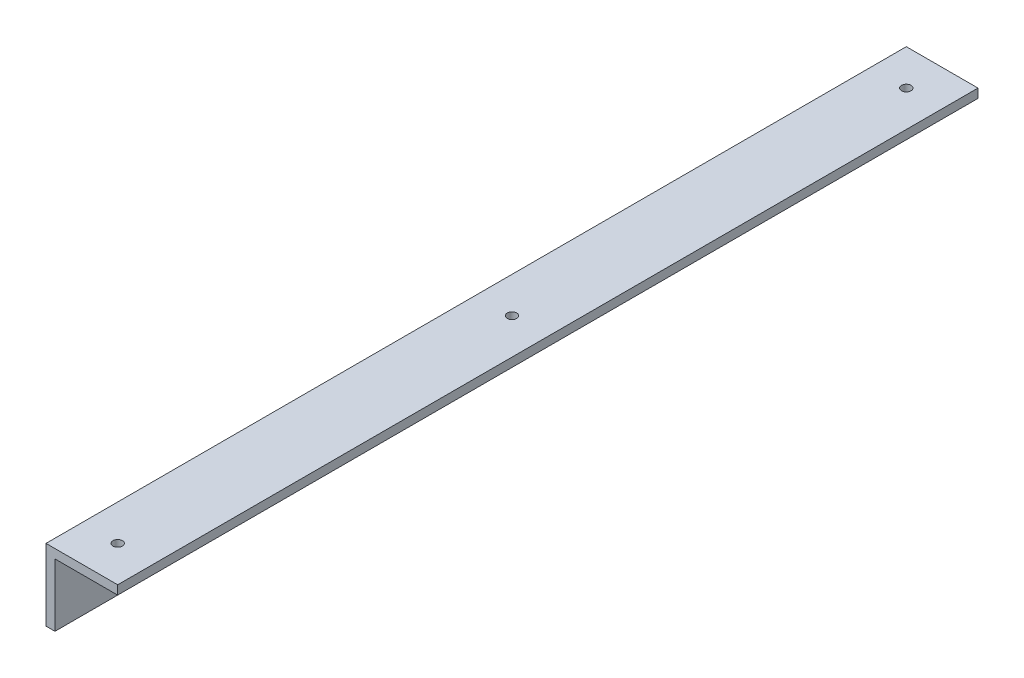
ISO-10303-21;
HEADER;
FILE_DESCRIPTION(('STEP AP214'),'2;1');
FILE_NAME('part.step','',(''),(''),'','','');
FILE_SCHEMA(('AUTOMOTIVE_DESIGN { 1 0 10303 214 1 1 1 1 }'));
ENDSEC;
DATA;
#1=APPLICATION_CONTEXT('core data for automotive mechanical design processes');
#2=APPLICATION_PROTOCOL_DEFINITION('international standard','automotive_design',2000,#1);
#3=PRODUCT_CONTEXT('',#1,'mechanical');
#4=PRODUCT('Part','Part','',(#3));
#5=PRODUCT_RELATED_PRODUCT_CATEGORY('part','',(#4));
#6=PRODUCT_DEFINITION_FORMATION('','',#4);
#7=PRODUCT_DEFINITION_CONTEXT('part definition',#1,'design');
#8=PRODUCT_DEFINITION('design','',#6,#7);
#9=PRODUCT_DEFINITION_SHAPE('','',#8);
#10=(LENGTH_UNIT() NAMED_UNIT(*) SI_UNIT(.MILLI.,.METRE.));
#11=(NAMED_UNIT(*) PLANE_ANGLE_UNIT() SI_UNIT($,.RADIAN.));
#12=(NAMED_UNIT(*) SI_UNIT($,.STERADIAN.) SOLID_ANGLE_UNIT());
#13=UNCERTAINTY_MEASURE_WITH_UNIT(LENGTH_MEASURE(1.E-05),#10,'distance_accuracy_value','');
#14=(GEOMETRIC_REPRESENTATION_CONTEXT(3) GLOBAL_UNCERTAINTY_ASSIGNED_CONTEXT((#13)) GLOBAL_UNIT_ASSIGNED_CONTEXT((#10,
#11,#12)) REPRESENTATION_CONTEXT('',''));
#15=CARTESIAN_POINT('',(0.,0.,0.));
#16=DIRECTION('',(0.,0.,1.));
#17=DIRECTION('',(1.,0.,0.));
#18=AXIS2_PLACEMENT_3D('',#15,#16,#17);
#19=CARTESIAN_POINT('',(0.,-25.4,304.8));
#20=DIRECTION('',(-1.,0.,0.));
#21=DIRECTION('',(0.,0.,1.));
#22=AXIS2_PLACEMENT_3D('',#19,#20,#21);
#23=CYLINDRICAL_SURFACE('',#22,3.3655);
#24=CARTESIAN_POINT('',(0.,-25.4,304.8));
#25=DIRECTION('',(-1.,0.,0.));
#26=DIRECTION('',(0.,0.,1.));
#27=AXIS2_PLACEMENT_3D('',#24,#25,#26);
#28=CIRCLE('',#27,3.3655);
#29=CARTESIAN_POINT('',(0.,-25.4,308.1655));
#30=VERTEX_POINT('',#29);
#31=EDGE_CURVE('E123',#30,#30,#28,.F.);
#32=ORIENTED_EDGE('',*,*,#31,.F.);
#33=EDGE_LOOP('',(#32));
#34=FACE_BOUND('',#33,.T.);
#35=CARTESIAN_POINT('',(6.35,-25.4,304.8));
#36=DIRECTION('',(-1.,0.,0.));
#37=DIRECTION('',(0.,0.,1.));
#38=AXIS2_PLACEMENT_3D('',#35,#36,#37);
#39=CIRCLE('',#38,3.3655);
#40=CARTESIAN_POINT('',(6.35,-25.4,308.1655));
#41=VERTEX_POINT('',#40);
#42=EDGE_CURVE('E20',#41,#41,#39,.T.);
#43=ORIENTED_EDGE('',*,*,#42,.F.);
#44=EDGE_LOOP('',(#43));
#45=FACE_BOUND('',#44,.T.);
#46=ADVANCED_FACE('F17',(#34,#45),#23,.F.);
#47=CARTESIAN_POINT('',(0.,-25.4,558.8));
#48=DIRECTION('',(-1.,0.,0.));
#49=DIRECTION('',(0.,0.,1.));
#50=AXIS2_PLACEMENT_3D('',#47,#48,#49);
#51=CYLINDRICAL_SURFACE('',#50,3.3655);
#52=CARTESIAN_POINT('',(0.,-25.4,558.8));
#53=DIRECTION('',(-1.,0.,0.));
#54=DIRECTION('',(0.,0.,1.));
#55=AXIS2_PLACEMENT_3D('',#52,#53,#54);
#56=CIRCLE('',#55,3.3655);
#57=CARTESIAN_POINT('',(0.,-25.4,562.1655));
#58=VERTEX_POINT('',#57);
#59=EDGE_CURVE('E120',#58,#58,#56,.F.);
#60=ORIENTED_EDGE('',*,*,#59,.F.);
#61=EDGE_LOOP('',(#60));
#62=FACE_BOUND('',#61,.T.);
#63=CARTESIAN_POINT('',(6.35,-25.4,558.8));
#64=DIRECTION('',(-1.,0.,0.));
#65=DIRECTION('',(0.,0.,1.));
#66=AXIS2_PLACEMENT_3D('',#63,#64,#65);
#67=CIRCLE('',#66,3.3655);
#68=CARTESIAN_POINT('',(6.35,-25.4,562.1655));
#69=VERTEX_POINT('',#68);
#70=EDGE_CURVE('E130',#69,#69,#67,.T.);
#71=ORIENTED_EDGE('',*,*,#70,.F.);
#72=EDGE_LOOP('',(#71));
#73=FACE_BOUND('',#72,.T.);
#74=ADVANCED_FACE('F139',(#62,#73),#51,.F.);
#75=CARTESIAN_POINT('',(0.,-15.875,50.8));
#76=DIRECTION('',(-1.,0.,0.));
#77=DIRECTION('',(0.,0.,1.));
#78=AXIS2_PLACEMENT_3D('',#75,#76,#77);
#79=CYLINDRICAL_SURFACE('',#78,3.3655);
#80=CARTESIAN_POINT('',(0.,-15.875,50.8));
#81=DIRECTION('',(-1.,0.,0.));
#82=DIRECTION('',(0.,0.,1.));
#83=AXIS2_PLACEMENT_3D('',#80,#81,#82);
#84=CIRCLE('',#83,3.3655);
#85=CARTESIAN_POINT('',(0.,-15.875,54.1655));
#86=VERTEX_POINT('',#85);
#87=EDGE_CURVE('E117',#86,#86,#84,.F.);
#88=ORIENTED_EDGE('',*,*,#87,.F.);
#89=EDGE_LOOP('',(#88));
#90=FACE_BOUND('',#89,.T.);
#91=CARTESIAN_POINT('',(6.35,-15.875,50.8));
#92=DIRECTION('',(-1.,0.,0.));
#93=DIRECTION('',(0.,0.,1.));
#94=AXIS2_PLACEMENT_3D('',#91,#92,#93);
#95=CIRCLE('',#94,3.3655);
#96=CARTESIAN_POINT('',(6.35,-15.875,54.1655));
#97=VERTEX_POINT('',#96);
#98=EDGE_CURVE('E127',#97,#97,#95,.T.);
#99=ORIENTED_EDGE('',*,*,#98,.F.);
#100=EDGE_LOOP('',(#99));
#101=FACE_BOUND('',#100,.T.);
#102=ADVANCED_FACE('F145',(#90,#101),#79,.F.);
#103=CARTESIAN_POINT('',(0.,-50.8,0.));
#104=DIRECTION('',(0.,-1.,0.));
#105=DIRECTION('',(0.,0.,-1.));
#106=AXIS2_PLACEMENT_3D('',#103,#104,#105);
#107=PLANE('',#106);
#108=DIRECTION('',(0.,0.,1.));
#109=VECTOR('',#108,1.);
#110=CARTESIAN_POINT('',(0.,-50.8,0.));
#111=LINE('',#110,#109);
#112=CARTESIAN_POINT('',(0.,-50.8000000000004,225.425));
#113=VERTEX_POINT('',#112);
#114=CARTESIAN_POINT('',(0.,-50.8,609.6));
#115=VERTEX_POINT('',#114);
#116=EDGE_CURVE('E74',#113,#115,#111,.T.);
#117=ORIENTED_EDGE('',*,*,#116,.F.);
#118=DIRECTION('',(1.,0.,0.));
#119=VECTOR('',#118,1.);
#120=CARTESIAN_POINT('',(3.175,-50.8000000000014,225.425));
#121=LINE('',#120,#119);
#122=CARTESIAN_POINT('',(6.35,-50.8000000000004,225.425));
#123=VERTEX_POINT('',#122);
#124=EDGE_CURVE('E76',#123,#113,#121,.F.);
#125=ORIENTED_EDGE('',*,*,#124,.F.);
#126=DIRECTION('',(0.,0.,-1.));
#127=VECTOR('',#126,1.);
#128=CARTESIAN_POINT('',(6.35,-50.8,0.));
#129=LINE('',#128,#127);
#130=CARTESIAN_POINT('',(6.35,-50.8,609.6));
#131=VERTEX_POINT('',#130);
#132=EDGE_CURVE('E80',#131,#123,#129,.T.);
#133=ORIENTED_EDGE('',*,*,#132,.F.);
#134=DIRECTION('',(1.,0.,0.));
#135=VECTOR('',#134,1.);
#136=CARTESIAN_POINT('',(0.,-50.8,609.6));
#137=LINE('',#136,#135);
#138=EDGE_CURVE('E222',#115,#131,#137,.T.);
#139=ORIENTED_EDGE('',*,*,#138,.F.);
#140=EDGE_LOOP('',(#117,#125,#133,#139));
#141=FACE_BOUND('',#140,.T.);
#142=ADVANCED_FACE('F78',(#141),#107,.T.);
#143=CARTESIAN_POINT('',(3.175,-34.925,112.7125));
#144=DIRECTION('',(0.,-0.990226505105836,-0.139468521845905));
#145=DIRECTION('',(0.,0.139468521845905,-0.990226505105836));
#146=AXIS2_PLACEMENT_3D('',#143,#144,#145);
#147=PLANE('',#146);
#148=ORIENTED_EDGE('',*,*,#124,.T.);
#149=DIRECTION('',(0.,-0.139468521845893,0.990226505105838));
#150=VECTOR('',#149,1.);
#151=CARTESIAN_POINT('',(0.,-19.05,0.));
#152=LINE('',#151,#150);
#153=CARTESIAN_POINT('',(0.,-19.0499999999993,0.));
#154=VERTEX_POINT('',#153);
#155=EDGE_CURVE('E126',#154,#113,#152,.T.);
#156=ORIENTED_EDGE('',*,*,#155,.F.);
#157=DIRECTION('',(1.,0.,0.));
#158=VECTOR('',#157,1.);
#159=CARTESIAN_POINT('',(0.,-19.05,0.));
#160=LINE('',#159,#158);
#161=CARTESIAN_POINT('',(6.35,-19.0499999999993,0.));
#162=VERTEX_POINT('',#161);
#163=EDGE_CURVE('E89',#154,#162,#160,.T.);
#164=ORIENTED_EDGE('',*,*,#163,.T.);
#165=DIRECTION('',(0.,0.139468521845893,-0.990226505105838));
#166=VECTOR('',#165,1.);
#167=CARTESIAN_POINT('',(6.35,-50.8,225.425));
#168=LINE('',#167,#166);
#169=EDGE_CURVE('E86',#123,#162,#168,.T.);
#170=ORIENTED_EDGE('',*,*,#169,.F.);
#171=EDGE_LOOP('',(#148,#156,#164,#170));
#172=FACE_BOUND('',#171,.T.);
#173=ADVANCED_FACE('F87',(#172),#147,.T.);
#174=CARTESIAN_POINT('',(6.35,-50.8,0.));
#175=DIRECTION('',(1.,0.,0.));
#176=DIRECTION('',(0.,0.,-1.));
#177=AXIS2_PLACEMENT_3D('',#174,#175,#176);
#178=PLANE('',#177);
#179=ORIENTED_EDGE('',*,*,#98,.T.);
#180=EDGE_LOOP('',(#179));
#181=FACE_BOUND('',#180,.T.);
#182=ORIENTED_EDGE('',*,*,#70,.T.);
#183=EDGE_LOOP('',(#182));
#184=FACE_BOUND('',#183,.T.);
#185=ORIENTED_EDGE('',*,*,#42,.T.);
#186=EDGE_LOOP('',(#185));
#187=FACE_BOUND('',#186,.T.);
#188=ORIENTED_EDGE('',*,*,#132,.T.);
#189=ORIENTED_EDGE('',*,*,#169,.T.);
#190=DIRECTION('',(0.,1.,0.));
#191=VECTOR('',#190,1.);
#192=CARTESIAN_POINT('',(6.35,0.,0.));
#193=LINE('',#192,#191);
#194=CARTESIAN_POINT('',(6.35,-6.35,0.));
#195=VERTEX_POINT('',#194);
#196=EDGE_CURVE('E211',#162,#195,#193,.T.);
#197=ORIENTED_EDGE('',*,*,#196,.T.);
#198=DIRECTION('',(0.,0.,-1.));
#199=VECTOR('',#198,1.);
#200=CARTESIAN_POINT('',(6.35,-6.35,0.));
#201=LINE('',#200,#199);
#202=CARTESIAN_POINT('',(6.35,-6.35,609.6));
#203=VERTEX_POINT('',#202);
#204=EDGE_CURVE('E129',#203,#195,#201,.T.);
#205=ORIENTED_EDGE('',*,*,#204,.F.);
#206=DIRECTION('',(0.,1.,0.));
#207=VECTOR('',#206,1.);
#208=CARTESIAN_POINT('',(6.35,0.,609.6));
#209=LINE('',#208,#207);
#210=EDGE_CURVE('E95',#131,#203,#209,.T.);
#211=ORIENTED_EDGE('',*,*,#210,.F.);
#212=EDGE_LOOP('',(#188,#189,#197,#205,#211));
#213=FACE_BOUND('',#212,.T.);
#214=ADVANCED_FACE('F93',(#181,#184,#187,#213),#178,.T.);
#215=CARTESIAN_POINT('',(6.35,-6.35,0.));
#216=DIRECTION('',(0.,-1.,0.));
#217=DIRECTION('',(0.,0.,-1.));
#218=AXIS2_PLACEMENT_3D('',#215,#216,#217);
#219=PLANE('',#218);
#220=CARTESIAN_POINT('',(25.4,-6.35,584.2));
#221=DIRECTION('',(0.,1.,0.));
#222=DIRECTION('',(0.,0.,1.));
#223=AXIS2_PLACEMENT_3D('',#220,#221,#222);
#224=CIRCLE('',#223,3.3655);
#225=CARTESIAN_POINT('',(25.4,-6.35,587.5655));
#226=VERTEX_POINT('',#225);
#227=EDGE_CURVE('E106',#226,#226,#224,.T.);
#228=ORIENTED_EDGE('',*,*,#227,.T.);
#229=EDGE_LOOP('',(#228));
#230=FACE_BOUND('',#229,.T.);
#231=CARTESIAN_POINT('',(25.4,-6.35,304.8));
#232=DIRECTION('',(0.,1.,0.));
#233=DIRECTION('',(0.,0.,1.));
#234=AXIS2_PLACEMENT_3D('',#231,#232,#233);
#235=CIRCLE('',#234,3.3655);
#236=CARTESIAN_POINT('',(25.4,-6.35,308.1655));
#237=VERTEX_POINT('',#236);
#238=EDGE_CURVE('E110',#237,#237,#235,.T.);
#239=ORIENTED_EDGE('',*,*,#238,.T.);
#240=EDGE_LOOP('',(#239));
#241=FACE_BOUND('',#240,.T.);
#242=CARTESIAN_POINT('',(25.4,-6.35,25.4));
#243=DIRECTION('',(0.,1.,0.));
#244=DIRECTION('',(0.,0.,1.));
#245=AXIS2_PLACEMENT_3D('',#242,#243,#244);
#246=CIRCLE('',#245,3.3655);
#247=CARTESIAN_POINT('',(25.4,-6.35,28.7655));
#248=VERTEX_POINT('',#247);
#249=EDGE_CURVE('E113',#248,#248,#246,.T.);
#250=ORIENTED_EDGE('',*,*,#249,.T.);
#251=EDGE_LOOP('',(#250));
#252=FACE_BOUND('',#251,.T.);
#253=ORIENTED_EDGE('',*,*,#204,.T.);
#254=DIRECTION('',(1.,0.,0.));
#255=VECTOR('',#254,1.);
#256=CARTESIAN_POINT('',(0.,-6.35,0.));
#257=LINE('',#256,#255);
#258=CARTESIAN_POINT('',(50.8,-6.35,0.));
#259=VERTEX_POINT('',#258);
#260=EDGE_CURVE('E214',#195,#259,#257,.T.);
#261=ORIENTED_EDGE('',*,*,#260,.T.);
#262=DIRECTION('',(0.,0.,-1.));
#263=VECTOR('',#262,1.);
#264=CARTESIAN_POINT('',(50.8,-6.35,0.));
#265=LINE('',#264,#263);
#266=CARTESIAN_POINT('',(50.8,-6.35,609.6));
#267=VERTEX_POINT('',#266);
#268=EDGE_CURVE('E212',#267,#259,#265,.T.);
#269=ORIENTED_EDGE('',*,*,#268,.F.);
#270=DIRECTION('',(1.,0.,0.));
#271=VECTOR('',#270,1.);
#272=CARTESIAN_POINT('',(0.,-6.35,609.6));
#273=LINE('',#272,#271);
#274=EDGE_CURVE('E227',#203,#267,#273,.T.);
#275=ORIENTED_EDGE('',*,*,#274,.F.);
#276=EDGE_LOOP('',(#253,#261,#269,#275));
#277=FACE_BOUND('',#276,.T.);
#278=ADVANCED_FACE('F182',(#230,#241,#252,#277),#219,.T.);
#279=CARTESIAN_POINT('',(0.,0.,0.));
#280=DIRECTION('',(-1.,0.,0.));
#281=DIRECTION('',(0.,0.,1.));
#282=AXIS2_PLACEMENT_3D('',#279,#280,#281);
#283=PLANE('',#282);
#284=ORIENTED_EDGE('',*,*,#87,.T.);
#285=EDGE_LOOP('',(#284));
#286=FACE_BOUND('',#285,.T.);
#287=ORIENTED_EDGE('',*,*,#59,.T.);
#288=EDGE_LOOP('',(#287));
#289=FACE_BOUND('',#288,.T.);
#290=ORIENTED_EDGE('',*,*,#31,.T.);
#291=EDGE_LOOP('',(#290));
#292=FACE_BOUND('',#291,.T.);
#293=DIRECTION('',(0.,1.,0.));
#294=VECTOR('',#293,1.);
#295=CARTESIAN_POINT('',(0.,0.,0.));
#296=LINE('',#295,#294);
#297=CARTESIAN_POINT('',(0.,0.,0.));
#298=VERTEX_POINT('',#297);
#299=EDGE_CURVE('E116',#298,#154,#296,.F.);
#300=ORIENTED_EDGE('',*,*,#299,.T.);
#301=ORIENTED_EDGE('',*,*,#155,.T.);
#302=ORIENTED_EDGE('',*,*,#116,.T.);
#303=DIRECTION('',(0.,1.,0.));
#304=VECTOR('',#303,1.);
#305=CARTESIAN_POINT('',(0.,0.,609.6));
#306=LINE('',#305,#304);
#307=CARTESIAN_POINT('',(0.,0.,609.6));
#308=VERTEX_POINT('',#307);
#309=EDGE_CURVE('E224',#308,#115,#306,.F.);
#310=ORIENTED_EDGE('',*,*,#309,.F.);
#311=DIRECTION('',(0.,0.,1.));
#312=VECTOR('',#311,1.);
#313=CARTESIAN_POINT('',(0.,0.,0.));
#314=LINE('',#313,#312);
#315=EDGE_CURVE('E109',#298,#308,#314,.T.);
#316=ORIENTED_EDGE('',*,*,#315,.F.);
#317=EDGE_LOOP('',(#300,#301,#302,#310,#316));
#318=FACE_BOUND('',#317,.T.);
#319=ADVANCED_FACE('F178',(#286,#289,#292,#318),#283,.T.);
#320=CARTESIAN_POINT('',(0.,0.,609.6));
#321=DIRECTION('',(0.,0.,1.));
#322=DIRECTION('',(1.,0.,0.));
#323=AXIS2_PLACEMENT_3D('',#320,#321,#322);
#324=PLANE('',#323);
#325=ORIENTED_EDGE('',*,*,#309,.T.);
#326=ORIENTED_EDGE('',*,*,#138,.T.);
#327=ORIENTED_EDGE('',*,*,#210,.T.);
#328=ORIENTED_EDGE('',*,*,#274,.T.);
#329=DIRECTION('',(0.,1.,0.));
#330=VECTOR('',#329,1.);
#331=CARTESIAN_POINT('',(50.8,-6.35,609.6));
#332=LINE('',#331,#330);
#333=CARTESIAN_POINT('',(50.8,0.,609.6));
#334=VERTEX_POINT('',#333);
#335=EDGE_CURVE('E216',#334,#267,#332,.F.);
#336=ORIENTED_EDGE('',*,*,#335,.F.);
#337=DIRECTION('',(1.,0.,0.));
#338=VECTOR('',#337,1.);
#339=CARTESIAN_POINT('',(50.8,0.,609.6));
#340=LINE('',#339,#338);
#341=EDGE_CURVE('E238',#308,#334,#340,.T.);
#342=ORIENTED_EDGE('',*,*,#341,.F.);
#343=EDGE_LOOP('',(#325,#326,#327,#328,#336,#342));
#344=FACE_BOUND('',#343,.T.);
#345=ADVANCED_FACE('F175',(#344),#324,.T.);
#346=CARTESIAN_POINT('',(50.8,-6.35,0.));
#347=DIRECTION('',(1.,0.,0.));
#348=DIRECTION('',(0.,0.,-1.));
#349=AXIS2_PLACEMENT_3D('',#346,#347,#348);
#350=PLANE('',#349);
#351=ORIENTED_EDGE('',*,*,#268,.T.);
#352=DIRECTION('',(0.,1.,0.));
#353=VECTOR('',#352,1.);
#354=CARTESIAN_POINT('',(50.8,0.,0.));
#355=LINE('',#354,#353);
#356=CARTESIAN_POINT('',(50.8,0.,0.));
#357=VERTEX_POINT('',#356);
#358=EDGE_CURVE('E35',#259,#357,#355,.T.);
#359=ORIENTED_EDGE('',*,*,#358,.T.);
#360=DIRECTION('',(0.,0.,1.));
#361=VECTOR('',#360,1.);
#362=CARTESIAN_POINT('',(50.8,0.,0.));
#363=LINE('',#362,#361);
#364=EDGE_CURVE('E241',#334,#357,#363,.F.);
#365=ORIENTED_EDGE('',*,*,#364,.F.);
#366=ORIENTED_EDGE('',*,*,#335,.T.);
#367=EDGE_LOOP('',(#351,#359,#365,#366));
#368=FACE_BOUND('',#367,.T.);
#369=ADVANCED_FACE('F171',(#368),#350,.T.);
#370=CARTESIAN_POINT('',(0.,0.,0.));
#371=DIRECTION('',(0.,0.,1.));
#372=DIRECTION('',(1.,0.,0.));
#373=AXIS2_PLACEMENT_3D('',#370,#371,#372);
#374=PLANE('',#373);
#375=DIRECTION('',(1.,0.,0.));
#376=VECTOR('',#375,1.);
#377=CARTESIAN_POINT('',(50.8,0.,0.));
#378=LINE('',#377,#376);
#379=EDGE_CURVE('E105',#357,#298,#378,.F.);
#380=ORIENTED_EDGE('',*,*,#379,.F.);
#381=ORIENTED_EDGE('',*,*,#358,.F.);
#382=ORIENTED_EDGE('',*,*,#260,.F.);
#383=ORIENTED_EDGE('',*,*,#196,.F.);
#384=ORIENTED_EDGE('',*,*,#163,.F.);
#385=ORIENTED_EDGE('',*,*,#299,.F.);
#386=EDGE_LOOP('',(#380,#381,#382,#383,#384,#385));
#387=FACE_BOUND('',#386,.T.);
#388=ADVANCED_FACE('F167',(#387),#374,.F.);
#389=CARTESIAN_POINT('',(25.4,0.,25.4));
#390=DIRECTION('',(0.,1.,0.));
#391=DIRECTION('',(0.,0.,1.));
#392=AXIS2_PLACEMENT_3D('',#389,#390,#391);
#393=CYLINDRICAL_SURFACE('',#392,3.3655);
#394=CARTESIAN_POINT('',(25.4,0.,25.4));
#395=DIRECTION('',(0.,1.,0.));
#396=DIRECTION('',(0.,0.,1.));
#397=AXIS2_PLACEMENT_3D('',#394,#395,#396);
#398=CIRCLE('',#397,3.3655);
#399=CARTESIAN_POINT('',(25.4,0.,28.7655));
#400=VERTEX_POINT('',#399);
#401=EDGE_CURVE('E102',#400,#400,#398,.F.);
#402=ORIENTED_EDGE('',*,*,#401,.F.);
#403=EDGE_LOOP('',(#402));
#404=FACE_BOUND('',#403,.T.);
#405=ORIENTED_EDGE('',*,*,#249,.F.);
#406=EDGE_LOOP('',(#405));
#407=FACE_BOUND('',#406,.T.);
#408=ADVANCED_FACE('F163',(#404,#407),#393,.F.);
#409=CARTESIAN_POINT('',(25.4,0.,304.8));
#410=DIRECTION('',(0.,1.,0.));
#411=DIRECTION('',(0.,0.,1.));
#412=AXIS2_PLACEMENT_3D('',#409,#410,#411);
#413=CYLINDRICAL_SURFACE('',#412,3.3655);
#414=CARTESIAN_POINT('',(25.4,0.,304.8));
#415=DIRECTION('',(0.,1.,0.));
#416=DIRECTION('',(0.,0.,1.));
#417=AXIS2_PLACEMENT_3D('',#414,#415,#416);
#418=CIRCLE('',#417,3.3655);
#419=CARTESIAN_POINT('',(25.4,0.,308.1655));
#420=VERTEX_POINT('',#419);
#421=EDGE_CURVE('E26',#420,#420,#418,.F.);
#422=ORIENTED_EDGE('',*,*,#421,.F.);
#423=EDGE_LOOP('',(#422));
#424=FACE_BOUND('',#423,.T.);
#425=ORIENTED_EDGE('',*,*,#238,.F.);
#426=EDGE_LOOP('',(#425));
#427=FACE_BOUND('',#426,.T.);
#428=ADVANCED_FACE('F156',(#424,#427),#413,.F.);
#429=CARTESIAN_POINT('',(25.4,0.,584.2));
#430=DIRECTION('',(0.,1.,0.));
#431=DIRECTION('',(0.,0.,1.));
#432=AXIS2_PLACEMENT_3D('',#429,#430,#431);
#433=CYLINDRICAL_SURFACE('',#432,3.3655);
#434=CARTESIAN_POINT('',(25.4,0.,584.2));
#435=DIRECTION('',(0.,1.,0.));
#436=DIRECTION('',(0.,0.,1.));
#437=AXIS2_PLACEMENT_3D('',#434,#435,#436);
#438=CIRCLE('',#437,3.3655);
#439=CARTESIAN_POINT('',(25.4,0.,587.5655));
#440=VERTEX_POINT('',#439);
#441=EDGE_CURVE('E11',#440,#440,#438,.F.);
#442=ORIENTED_EDGE('',*,*,#441,.F.);
#443=EDGE_LOOP('',(#442));
#444=FACE_BOUND('',#443,.T.);
#445=ORIENTED_EDGE('',*,*,#227,.F.);
#446=EDGE_LOOP('',(#445));
#447=FACE_BOUND('',#446,.T.);
#448=ADVANCED_FACE('F150',(#444,#447),#433,.F.);
#449=CARTESIAN_POINT('',(50.8,0.,0.));
#450=DIRECTION('',(0.,1.,0.));
#451=DIRECTION('',(0.,0.,1.));
#452=AXIS2_PLACEMENT_3D('',#449,#450,#451);
#453=PLANE('',#452);
#454=ORIENTED_EDGE('',*,*,#441,.T.);
#455=EDGE_LOOP('',(#454));
#456=FACE_BOUND('',#455,.T.);
#457=ORIENTED_EDGE('',*,*,#421,.T.);
#458=EDGE_LOOP('',(#457));
#459=FACE_BOUND('',#458,.T.);
#460=ORIENTED_EDGE('',*,*,#401,.T.);
#461=EDGE_LOOP('',(#460));
#462=FACE_BOUND('',#461,.T.);
#463=ORIENTED_EDGE('',*,*,#364,.T.);
#464=ORIENTED_EDGE('',*,*,#379,.T.);
#465=ORIENTED_EDGE('',*,*,#315,.T.);
#466=ORIENTED_EDGE('',*,*,#341,.T.);
#467=EDGE_LOOP('',(#463,#464,#465,#466));
#468=FACE_BOUND('',#467,.T.);
#469=ADVANCED_FACE('F148',(#456,#459,#462,#468),#453,.T.);
#470=CLOSED_SHELL('',(#46,#74,#102,#142,#173,#214,#278,#319,#345,#369,#388,#408,#428,#448,#469));
#471=MANIFOLD_SOLID_BREP('B1',#470);
#472=ADVANCED_BREP_SHAPE_REPRESENTATION('',(#18,#471),#14);
#473=SHAPE_DEFINITION_REPRESENTATION(#9,#472);
ENDSEC;
END-ISO-10303-21;
